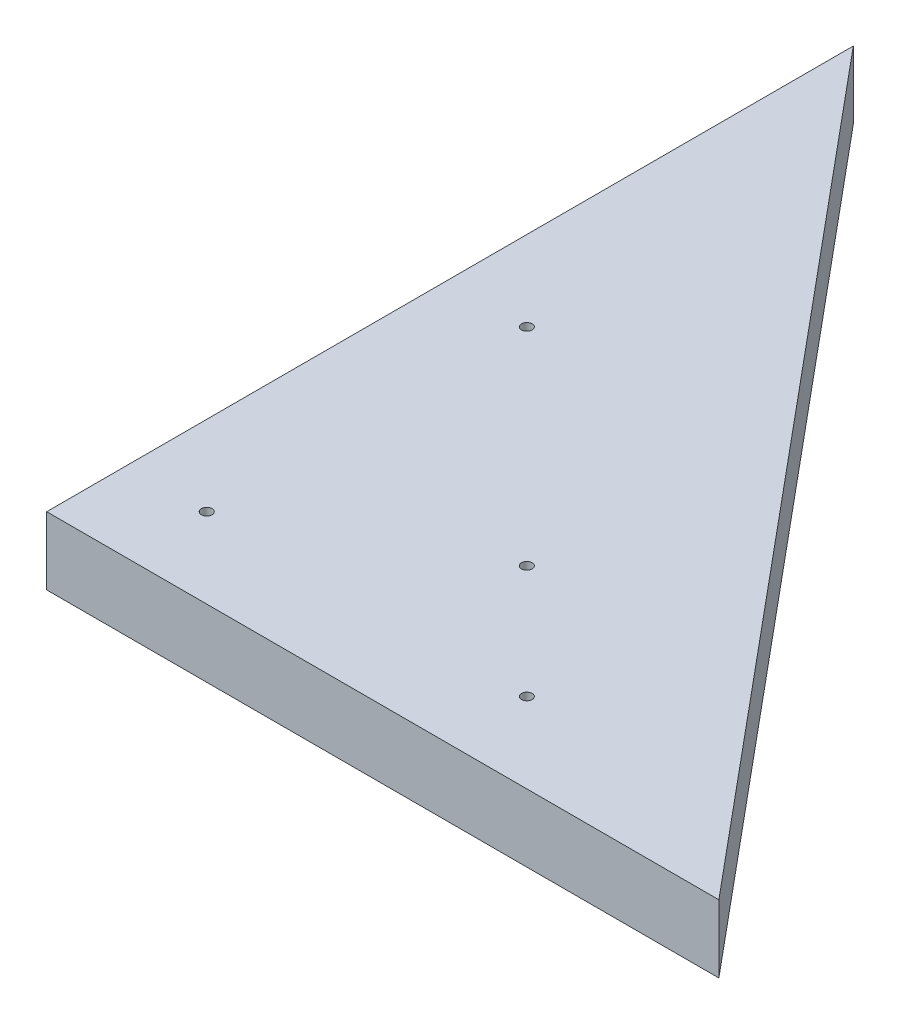
ISO-10303-21;
HEADER;
FILE_DESCRIPTION(('STEP AP214'),'2;1');
FILE_NAME('part.step','',(''),(''),'','','');
FILE_SCHEMA(('AUTOMOTIVE_DESIGN { 1 0 10303 214 1 1 1 1 }'));
ENDSEC;
DATA;
#1=APPLICATION_CONTEXT('core data for automotive mechanical design processes');
#2=APPLICATION_PROTOCOL_DEFINITION('international standard','automotive_design',2000,#1);
#3=PRODUCT_CONTEXT('',#1,'mechanical');
#4=PRODUCT('Part','Part','',(#3));
#5=PRODUCT_RELATED_PRODUCT_CATEGORY('part','',(#4));
#6=PRODUCT_DEFINITION_FORMATION('','',#4);
#7=PRODUCT_DEFINITION_CONTEXT('part definition',#1,'design');
#8=PRODUCT_DEFINITION('design','',#6,#7);
#9=PRODUCT_DEFINITION_SHAPE('','',#8);
#10=(LENGTH_UNIT() NAMED_UNIT(*) SI_UNIT(.MILLI.,.METRE.));
#11=(NAMED_UNIT(*) PLANE_ANGLE_UNIT() SI_UNIT($,.RADIAN.));
#12=(NAMED_UNIT(*) SI_UNIT($,.STERADIAN.) SOLID_ANGLE_UNIT());
#13=UNCERTAINTY_MEASURE_WITH_UNIT(LENGTH_MEASURE(1.E-05),#10,'distance_accuracy_value','');
#14=(GEOMETRIC_REPRESENTATION_CONTEXT(3) GLOBAL_UNCERTAINTY_ASSIGNED_CONTEXT((#13)) GLOBAL_UNIT_ASSIGNED_CONTEXT((#10,
#11,#12)) REPRESENTATION_CONTEXT('',''));
#15=CARTESIAN_POINT('',(0.,0.,0.));
#16=DIRECTION('',(0.,0.,1.));
#17=DIRECTION('',(1.,0.,0.));
#18=AXIS2_PLACEMENT_3D('',#15,#16,#17);
#19=CARTESIAN_POINT('',(-30.,209.518291832848,30.));
#20=DIRECTION('',(0.,-1.,0.));
#21=DIRECTION('',(0.,0.,-1.));
#22=AXIS2_PLACEMENT_3D('',#19,#20,#21);
#23=CYLINDRICAL_SURFACE('',#22,0.999999999999998);
#24=CARTESIAN_POINT('',(-30.,0.,30.));
#25=DIRECTION('',(0.,1.,0.));
#26=DIRECTION('',(0.,0.,1.));
#27=AXIS2_PLACEMENT_3D('',#24,#25,#26);
#28=CIRCLE('',#27,0.999999999999998);
#29=CARTESIAN_POINT('',(-30.,0.,29.));
#30=VERTEX_POINT('',#29);
#31=EDGE_CURVE('E95',#30,#30,#28,.T.);
#32=CARTESIAN_POINT('',(-30.,12.7,30.));
#33=DIRECTION('',(0.,1.,0.));
#34=DIRECTION('',(0.,0.,1.));
#35=AXIS2_PLACEMENT_3D('',#32,#33,#34);
#36=CIRCLE('',#35,0.999999999999998);
#37=CARTESIAN_POINT('',(-30.,12.7,29.));
#38=VERTEX_POINT('',#37);
#39=EDGE_CURVE('E86',#38,#38,#36,.T.);
#40=CARTESIAN_POINT('',(-30.,0.,29.));
#41=CARTESIAN_POINT('',(-30.,0.132291666666636,29.));
#42=CARTESIAN_POINT('',(-30.,0.2645833333333,29.));
#43=CARTESIAN_POINT('',(-30.,0.529166666666636,29.));
#44=CARTESIAN_POINT('',(-30.,0.661458333333309,29.));
#45=CARTESIAN_POINT('',(-30.,0.926041666666646,29.));
#46=CARTESIAN_POINT('',(-30.,1.05833333333331,29.));
#47=CARTESIAN_POINT('',(-30.,1.32291666666664,29.));
#48=CARTESIAN_POINT('',(-30.,1.4552083333333,29.));
#49=CARTESIAN_POINT('',(-30.,1.71979166666664,29.));
#50=CARTESIAN_POINT('',(-30.,1.85208333333331,29.));
#51=CARTESIAN_POINT('',(-30.,2.11666666666665,29.));
#52=CARTESIAN_POINT('',(-30.,2.24895833333331,29.));
#53=CARTESIAN_POINT('',(-30.,2.51354166666664,29.));
#54=CARTESIAN_POINT('',(-30.,2.6458333333333,29.));
#55=CARTESIAN_POINT('',(-30.,2.91041666666663,29.));
#56=CARTESIAN_POINT('',(-30.,3.04270833333329,29.));
#57=CARTESIAN_POINT('',(-30.,3.30729166666663,29.));
#58=CARTESIAN_POINT('',(-30.,3.4395833333333,29.));
#59=CARTESIAN_POINT('',(-30.,3.70416666666664,29.));
#60=CARTESIAN_POINT('',(-30.,3.8364583333333,29.));
#61=CARTESIAN_POINT('',(-30.,4.10104166666663,29.));
#62=CARTESIAN_POINT('',(-30.,4.23333333333329,29.));
#63=CARTESIAN_POINT('',(-30.,4.49791666666663,29.));
#64=CARTESIAN_POINT('',(-30.,4.6302083333333,29.));
#65=CARTESIAN_POINT('',(-30.,4.89479166666664,29.));
#66=CARTESIAN_POINT('',(-30.,5.0270833333333,29.));
#67=CARTESIAN_POINT('',(-30.,5.29166666666663,29.));
#68=CARTESIAN_POINT('',(-30.,5.42395833333329,29.));
#69=CARTESIAN_POINT('',(-30.,5.68854166666663,29.));
#70=CARTESIAN_POINT('',(-30.,5.8208333333333,29.));
#71=CARTESIAN_POINT('',(-30.,6.08541666666664,29.));
#72=CARTESIAN_POINT('',(-30.,6.2177083333333,29.));
#73=CARTESIAN_POINT('',(-30.,6.48229166666663,29.));
#74=CARTESIAN_POINT('',(-30.,6.61458333333329,29.));
#75=CARTESIAN_POINT('',(-30.,6.87916666666663,29.));
#76=CARTESIAN_POINT('',(-30.,7.0114583333333,29.));
#77=CARTESIAN_POINT('',(-30.,7.27604166666664,29.));
#78=CARTESIAN_POINT('',(-30.,7.4083333333333,29.));
#79=CARTESIAN_POINT('',(-30.,7.67291666666663,29.));
#80=CARTESIAN_POINT('',(-30.,7.80520833333329,29.));
#81=CARTESIAN_POINT('',(-30.,8.06979166666663,29.));
#82=CARTESIAN_POINT('',(-30.,8.2020833333333,29.));
#83=CARTESIAN_POINT('',(-30.,8.46666666666664,29.));
#84=CARTESIAN_POINT('',(-30.,8.5989583333333,29.));
#85=CARTESIAN_POINT('',(-30.,8.86354166666663,29.));
#86=CARTESIAN_POINT('',(-30.,8.99583333333329,29.));
#87=CARTESIAN_POINT('',(-30.,9.26041666666663,29.));
#88=CARTESIAN_POINT('',(-30.,9.3927083333333,29.));
#89=CARTESIAN_POINT('',(-30.,9.65729166666664,29.));
#90=CARTESIAN_POINT('',(-30.,9.7895833333333,29.));
#91=CARTESIAN_POINT('',(-30.,10.0541666666666,29.));
#92=CARTESIAN_POINT('',(-30.,10.1864583333333,29.));
#93=CARTESIAN_POINT('',(-30.,10.4510416666666,29.));
#94=CARTESIAN_POINT('',(-30.,10.5833333333333,29.));
#95=CARTESIAN_POINT('',(-30.,10.8479166666666,29.));
#96=CARTESIAN_POINT('',(-30.,10.9802083333333,29.));
#97=CARTESIAN_POINT('',(-30.,11.2447916666666,29.));
#98=CARTESIAN_POINT('',(-30.,11.3770833333333,29.));
#99=CARTESIAN_POINT('',(-30.,11.6416666666666,29.));
#100=CARTESIAN_POINT('',(-30.,11.7739583333333,29.));
#101=CARTESIAN_POINT('',(-30.,12.0385416666666,29.));
#102=CARTESIAN_POINT('',(-30.,12.1708333333333,29.));
#103=CARTESIAN_POINT('',(-30.,12.4354166666666,29.));
#104=CARTESIAN_POINT('',(-30.,12.5677083333333,29.));
#105=CARTESIAN_POINT('',(-30.,12.7,29.));
#106=B_SPLINE_CURVE_WITH_KNOTS('',3,(#40,#41,#42,#43,#44,#45,#46,#47,#48,#49,#50,#51,#52,#53,
#54,#55,#56,#57,#58,#59,#60,#61,#62,#63,#64,#65,#66,#67,#68,#69,#70,#71,#72,#73,#74,#75,#76,#77,
#78,#79,#80,#81,#82,#83,#84,#85,#86,#87,#88,#89,#90,#91,#92,#93,#94,#95,#96,#97,#98,#99,#100,
#101,#102,#103,#104,#105),.UNSPECIFIED.,.F.,.F.,(4,2,2,2,2,2,2,2,2,2,2,2,2,2,2,2,2,2,2,2,2,2,2,
2,2,2,2,2,2,2,2,2,4),(0.,0.396874999999991,0.79375000000001,1.190625,1.58749999999999,
1.98437500000001,2.38125,2.77812499999999,3.17499999999998,3.571875,3.96874999999999,
4.36562499999998,4.7625,5.15937499999999,5.55624999999998,5.953125,6.34999999999999,
6.74687499999999,7.14375,7.540625,7.93749999999999,8.334375,8.73125,9.12812499999999,
9.52500000000001,9.921875,10.31875,10.715625,11.1125,11.509375,11.90625,12.303125,12.7),.UNSPECIFIED.);
#107=EDGE_CURVE('BSEAM33',#30,#38,#106,.T.);
#108=ORIENTED_EDGE('',*,*,#31,.F.);
#109=ORIENTED_EDGE('',*,*,#39,.T.);
#110=ORIENTED_EDGE('',*,*,#107,.T.);
#111=ORIENTED_EDGE('',*,*,#107,.F.);
#112=EDGE_LOOP('',(#108,#110,#109,#111));
#113=FACE_BOUND('',#112,.T.);
#114=ADVANCED_FACE('F33',(#113),#23,.F.);
#115=CARTESIAN_POINT('',(81.,209.518291832848,45.));
#116=DIRECTION('',(0.,0.,-1.));
#117=DIRECTION('',(-1.,0.,0.));
#118=AXIS2_PLACEMENT_3D('',#115,#116,#117);
#119=PLANE('',#118);
#120=DIRECTION('',(1.,0.,0.));
#121=VECTOR('',#120,1.);
#122=CARTESIAN_POINT('',(81.,12.7,45.));
#123=LINE('',#122,#121);
#124=CARTESIAN_POINT('',(-45.,12.7,45.));
#125=VERTEX_POINT('',#124);
#126=CARTESIAN_POINT('',(81.,12.7,45.));
#127=VERTEX_POINT('',#126);
#128=EDGE_CURVE('E69',#125,#127,#123,.T.);
#129=ORIENTED_EDGE('',*,*,#128,.F.);
#130=DIRECTION('',(0.,-1.,0.));
#131=VECTOR('',#130,1.);
#132=CARTESIAN_POINT('',(-45.,209.518291832848,45.));
#133=LINE('',#132,#131);
#134=CARTESIAN_POINT('',(-45.,0.,45.));
#135=VERTEX_POINT('',#134);
#136=EDGE_CURVE('E42',#125,#135,#133,.T.);
#137=ORIENTED_EDGE('',*,*,#136,.T.);
#138=DIRECTION('',(1.,0.,0.));
#139=VECTOR('',#138,1.);
#140=CARTESIAN_POINT('',(81.,0.,45.));
#141=LINE('',#140,#139);
#142=CARTESIAN_POINT('',(81.,0.,45.));
#143=VERTEX_POINT('',#142);
#144=EDGE_CURVE('E71',#135,#143,#141,.T.);
#145=ORIENTED_EDGE('',*,*,#144,.T.);
#146=DIRECTION('',(0.,-1.,0.));
#147=VECTOR('',#146,1.);
#148=CARTESIAN_POINT('',(81.,209.518291832848,45.));
#149=LINE('',#148,#147);
#150=EDGE_CURVE('E65',#127,#143,#149,.T.);
#151=ORIENTED_EDGE('',*,*,#150,.F.);
#152=EDGE_LOOP('',(#129,#137,#145,#151));
#153=FACE_BOUND('',#152,.T.);
#154=ADVANCED_FACE('F67',(#153),#119,.F.);
#155=CARTESIAN_POINT('',(-45.,209.518291832848,45.));
#156=DIRECTION('',(1.,0.,0.));
#157=DIRECTION('',(0.,0.,-1.));
#158=AXIS2_PLACEMENT_3D('',#155,#156,#157);
#159=PLANE('',#158);
#160=DIRECTION('',(0.,0.,1.));
#161=VECTOR('',#160,1.);
#162=CARTESIAN_POINT('',(-45.,12.7,45.));
#163=LINE('',#162,#161);
#164=CARTESIAN_POINT('',(-45.,12.7,-106.2));
#165=VERTEX_POINT('',#164);
#166=EDGE_CURVE('E52',#165,#125,#163,.T.);
#167=ORIENTED_EDGE('',*,*,#166,.F.);
#168=DIRECTION('',(0.,-1.,0.));
#169=VECTOR('',#168,1.);
#170=CARTESIAN_POINT('',(-45.,209.518291832848,-106.2));
#171=LINE('',#170,#169);
#172=CARTESIAN_POINT('',(-45.,0.,-106.2));
#173=VERTEX_POINT('',#172);
#174=EDGE_CURVE('E11',#165,#173,#171,.T.);
#175=ORIENTED_EDGE('',*,*,#174,.T.);
#176=DIRECTION('',(0.,0.,1.));
#177=VECTOR('',#176,1.);
#178=CARTESIAN_POINT('',(-45.,0.,45.));
#179=LINE('',#178,#177);
#180=EDGE_CURVE('E103',#173,#135,#179,.T.);
#181=ORIENTED_EDGE('',*,*,#180,.T.);
#182=ORIENTED_EDGE('',*,*,#136,.F.);
#183=EDGE_LOOP('',(#167,#175,#181,#182));
#184=FACE_BOUND('',#183,.T.);
#185=ADVANCED_FACE('F107',(#184),#159,.F.);
#186=CARTESIAN_POINT('',(-45.,209.518291832848,-106.2));
#187=DIRECTION('',(-0.768221279597376,0.,0.64018439966448));
#188=DIRECTION('',(0.64018439966448,0.,0.768221279597376));
#189=AXIS2_PLACEMENT_3D('',#186,#187,#188);
#190=PLANE('',#189);
#191=DIRECTION('',(-0.64018439966448,0.,-0.768221279597376));
#192=VECTOR('',#191,1.);
#193=CARTESIAN_POINT('',(-45.,12.7,-106.2));
#194=LINE('',#193,#192);
#195=EDGE_CURVE('E77',#127,#165,#194,.T.);
#196=ORIENTED_EDGE('',*,*,#195,.F.);
#197=ORIENTED_EDGE('',*,*,#150,.T.);
#198=DIRECTION('',(-0.64018439966448,0.,-0.768221279597376));
#199=VECTOR('',#198,1.);
#200=CARTESIAN_POINT('',(-45.,0.,-106.2));
#201=LINE('',#200,#199);
#202=EDGE_CURVE('E101',#143,#173,#201,.T.);
#203=ORIENTED_EDGE('',*,*,#202,.T.);
#204=ORIENTED_EDGE('',*,*,#174,.F.);
#205=EDGE_LOOP('',(#196,#197,#203,#204));
#206=FACE_BOUND('',#205,.T.);
#207=ADVANCED_FACE('F35',(#206),#190,.F.);
#208=CARTESIAN_POINT('',(-30.,209.518291832848,-30.));
#209=DIRECTION('',(0.,-1.,0.));
#210=DIRECTION('',(0.,0.,-1.));
#211=AXIS2_PLACEMENT_3D('',#208,#209,#210);
#212=CYLINDRICAL_SURFACE('',#211,0.999999999999998);
#213=CARTESIAN_POINT('',(-30.,0.,-30.));
#214=DIRECTION('',(0.,1.,0.));
#215=DIRECTION('',(0.,0.,1.));
#216=AXIS2_PLACEMENT_3D('',#213,#214,#215);
#217=CIRCLE('',#216,0.999999999999998);
#218=CARTESIAN_POINT('',(-30.,0.,-31.));
#219=VERTEX_POINT('',#218);
#220=EDGE_CURVE('E98',#219,#219,#217,.T.);
#221=CARTESIAN_POINT('',(-30.,12.7,-30.));
#222=DIRECTION('',(0.,1.,0.));
#223=DIRECTION('',(0.,0.,1.));
#224=AXIS2_PLACEMENT_3D('',#221,#222,#223);
#225=CIRCLE('',#224,0.999999999999998);
#226=CARTESIAN_POINT('',(-30.,12.7,-31.));
#227=VERTEX_POINT('',#226);
#228=EDGE_CURVE('E82',#227,#227,#225,.T.);
#229=CARTESIAN_POINT('',(-30.,0.,-31.));
#230=CARTESIAN_POINT('',(-30.,0.132291666666636,-31.));
#231=CARTESIAN_POINT('',(-30.,0.2645833333333,-31.));
#232=CARTESIAN_POINT('',(-30.,0.529166666666636,-31.));
#233=CARTESIAN_POINT('',(-30.,0.661458333333309,-31.));
#234=CARTESIAN_POINT('',(-30.,0.926041666666646,-31.));
#235=CARTESIAN_POINT('',(-30.,1.05833333333331,-31.));
#236=CARTESIAN_POINT('',(-30.,1.32291666666664,-31.));
#237=CARTESIAN_POINT('',(-30.,1.4552083333333,-31.));
#238=CARTESIAN_POINT('',(-30.,1.71979166666664,-31.));
#239=CARTESIAN_POINT('',(-30.,1.85208333333331,-31.));
#240=CARTESIAN_POINT('',(-30.,2.11666666666665,-31.));
#241=CARTESIAN_POINT('',(-30.,2.24895833333331,-31.));
#242=CARTESIAN_POINT('',(-30.,2.51354166666664,-31.));
#243=CARTESIAN_POINT('',(-30.,2.6458333333333,-31.));
#244=CARTESIAN_POINT('',(-30.,2.91041666666663,-31.));
#245=CARTESIAN_POINT('',(-30.,3.04270833333329,-31.));
#246=CARTESIAN_POINT('',(-30.,3.30729166666663,-31.));
#247=CARTESIAN_POINT('',(-30.,3.4395833333333,-31.));
#248=CARTESIAN_POINT('',(-30.,3.70416666666664,-31.));
#249=CARTESIAN_POINT('',(-30.,3.8364583333333,-31.));
#250=CARTESIAN_POINT('',(-30.,4.10104166666663,-31.));
#251=CARTESIAN_POINT('',(-30.,4.23333333333329,-31.));
#252=CARTESIAN_POINT('',(-30.,4.49791666666663,-31.));
#253=CARTESIAN_POINT('',(-30.,4.6302083333333,-31.));
#254=CARTESIAN_POINT('',(-30.,4.89479166666664,-31.));
#255=CARTESIAN_POINT('',(-30.,5.0270833333333,-31.));
#256=CARTESIAN_POINT('',(-30.,5.29166666666663,-31.));
#257=CARTESIAN_POINT('',(-30.,5.42395833333329,-31.));
#258=CARTESIAN_POINT('',(-30.,5.68854166666663,-31.));
#259=CARTESIAN_POINT('',(-30.,5.8208333333333,-31.));
#260=CARTESIAN_POINT('',(-30.,6.08541666666664,-31.));
#261=CARTESIAN_POINT('',(-30.,6.2177083333333,-31.));
#262=CARTESIAN_POINT('',(-30.,6.48229166666663,-31.));
#263=CARTESIAN_POINT('',(-30.,6.61458333333329,-31.));
#264=CARTESIAN_POINT('',(-30.,6.87916666666663,-31.));
#265=CARTESIAN_POINT('',(-30.,7.0114583333333,-31.));
#266=CARTESIAN_POINT('',(-30.,7.27604166666664,-31.));
#267=CARTESIAN_POINT('',(-30.,7.4083333333333,-31.));
#268=CARTESIAN_POINT('',(-30.,7.67291666666663,-31.));
#269=CARTESIAN_POINT('',(-30.,7.80520833333329,-31.));
#270=CARTESIAN_POINT('',(-30.,8.06979166666663,-31.));
#271=CARTESIAN_POINT('',(-30.,8.2020833333333,-31.));
#272=CARTESIAN_POINT('',(-30.,8.46666666666664,-31.));
#273=CARTESIAN_POINT('',(-30.,8.5989583333333,-31.));
#274=CARTESIAN_POINT('',(-30.,8.86354166666663,-31.));
#275=CARTESIAN_POINT('',(-30.,8.99583333333329,-31.));
#276=CARTESIAN_POINT('',(-30.,9.26041666666663,-31.));
#277=CARTESIAN_POINT('',(-30.,9.3927083333333,-31.));
#278=CARTESIAN_POINT('',(-30.,9.65729166666664,-31.));
#279=CARTESIAN_POINT('',(-30.,9.7895833333333,-31.));
#280=CARTESIAN_POINT('',(-30.,10.0541666666666,-31.));
#281=CARTESIAN_POINT('',(-30.,10.1864583333333,-31.));
#282=CARTESIAN_POINT('',(-30.,10.4510416666666,-31.));
#283=CARTESIAN_POINT('',(-30.,10.5833333333333,-31.));
#284=CARTESIAN_POINT('',(-30.,10.8479166666666,-31.));
#285=CARTESIAN_POINT('',(-30.,10.9802083333333,-31.));
#286=CARTESIAN_POINT('',(-30.,11.2447916666666,-31.));
#287=CARTESIAN_POINT('',(-30.,11.3770833333333,-31.));
#288=CARTESIAN_POINT('',(-30.,11.6416666666666,-31.));
#289=CARTESIAN_POINT('',(-30.,11.7739583333333,-31.));
#290=CARTESIAN_POINT('',(-30.,12.0385416666666,-31.));
#291=CARTESIAN_POINT('',(-30.,12.1708333333333,-31.));
#292=CARTESIAN_POINT('',(-30.,12.4354166666666,-31.));
#293=CARTESIAN_POINT('',(-30.,12.5677083333333,-31.));
#294=CARTESIAN_POINT('',(-30.,12.7,-31.));
#295=B_SPLINE_CURVE_WITH_KNOTS('',3,(#229,#230,#231,#232,#233,#234,#235,#236,#237,#238,#239,
#240,#241,#242,#243,#244,#245,#246,#247,#248,#249,#250,#251,#252,#253,#254,#255,#256,#257,#258,
#259,#260,#261,#262,#263,#264,#265,#266,#267,#268,#269,#270,#271,#272,#273,#274,#275,#276,#277,
#278,#279,#280,#281,#282,#283,#284,#285,#286,#287,#288,#289,#290,#291,#292,#293,#294),
.UNSPECIFIED.,.F.,.F.,(4,2,2,2,2,2,2,2,2,2,2,2,2,2,2,2,2,2,2,2,2,2,2,2,2,2,2,2,2,2,2,2,4),(0.,
0.396874999999991,0.79375000000001,1.190625,1.58749999999999,1.98437500000001,2.38125,
2.77812499999999,3.17499999999998,3.571875,3.96874999999999,4.36562499999998,4.7625,
5.15937499999999,5.55624999999998,5.953125,6.34999999999999,6.74687499999999,7.14375,7.540625,
7.93749999999999,8.334375,8.73125,9.12812499999999,9.52500000000001,9.921875,10.31875,10.715625,
11.1125,11.509375,11.90625,12.303125,12.7),.UNSPECIFIED.);
#296=EDGE_CURVE('BSEAM140',#219,#227,#295,.T.);
#297=ORIENTED_EDGE('',*,*,#220,.F.);
#298=ORIENTED_EDGE('',*,*,#228,.T.);
#299=ORIENTED_EDGE('',*,*,#296,.T.);
#300=ORIENTED_EDGE('',*,*,#296,.F.);
#301=EDGE_LOOP('',(#297,#299,#298,#300));
#302=FACE_BOUND('',#301,.T.);
#303=ADVANCED_FACE('F140',(#302),#212,.F.);
#304=CARTESIAN_POINT('',(8.78679656440357,209.518291832848,8.78679656440358));
#305=DIRECTION('',(0.,-1.,0.));
#306=DIRECTION('',(0.,0.,-1.));
#307=AXIS2_PLACEMENT_3D('',#304,#305,#306);
#308=CYLINDRICAL_SURFACE('',#307,1.);
#309=CARTESIAN_POINT('',(8.78679656440357,0.,8.78679656440358));
#310=DIRECTION('',(0.,1.,0.));
#311=DIRECTION('',(0.,0.,1.));
#312=AXIS2_PLACEMENT_3D('',#309,#310,#311);
#313=CIRCLE('',#312,1.);
#314=CARTESIAN_POINT('',(8.78679656440357,0.,7.78679656440357));
#315=VERTEX_POINT('',#314);
#316=EDGE_CURVE('E92',#315,#315,#313,.T.);
#317=CARTESIAN_POINT('',(8.78679656440357,12.7,8.78679656440358));
#318=DIRECTION('',(0.,1.,0.));
#319=DIRECTION('',(0.,0.,1.));
#320=AXIS2_PLACEMENT_3D('',#317,#318,#319);
#321=CIRCLE('',#320,1.);
#322=CARTESIAN_POINT('',(8.78679656440357,12.7,7.78679656440357));
#323=VERTEX_POINT('',#322);
#324=EDGE_CURVE('E126',#323,#323,#321,.T.);
#325=CARTESIAN_POINT('',(8.78679656440357,0.,7.78679656440357));
#326=CARTESIAN_POINT('',(8.78679656440357,0.132291666666636,7.78679656440357));
#327=CARTESIAN_POINT('',(8.78679656440357,0.2645833333333,7.78679656440357));
#328=CARTESIAN_POINT('',(8.78679656440357,0.529166666666636,7.78679656440357));
#329=CARTESIAN_POINT('',(8.78679656440357,0.661458333333309,7.78679656440357));
#330=CARTESIAN_POINT('',(8.78679656440357,0.926041666666646,7.78679656440357));
#331=CARTESIAN_POINT('',(8.78679656440357,1.05833333333331,7.78679656440357));
#332=CARTESIAN_POINT('',(8.78679656440357,1.32291666666664,7.78679656440357));
#333=CARTESIAN_POINT('',(8.78679656440357,1.4552083333333,7.78679656440357));
#334=CARTESIAN_POINT('',(8.78679656440357,1.71979166666664,7.78679656440357));
#335=CARTESIAN_POINT('',(8.78679656440357,1.85208333333331,7.78679656440357));
#336=CARTESIAN_POINT('',(8.78679656440357,2.11666666666665,7.78679656440357));
#337=CARTESIAN_POINT('',(8.78679656440357,2.24895833333331,7.78679656440357));
#338=CARTESIAN_POINT('',(8.78679656440357,2.51354166666664,7.78679656440357));
#339=CARTESIAN_POINT('',(8.78679656440357,2.6458333333333,7.78679656440357));
#340=CARTESIAN_POINT('',(8.78679656440357,2.91041666666663,7.78679656440357));
#341=CARTESIAN_POINT('',(8.78679656440357,3.04270833333329,7.78679656440357));
#342=CARTESIAN_POINT('',(8.78679656440357,3.30729166666663,7.78679656440357));
#343=CARTESIAN_POINT('',(8.78679656440357,3.4395833333333,7.78679656440357));
#344=CARTESIAN_POINT('',(8.78679656440357,3.70416666666664,7.78679656440357));
#345=CARTESIAN_POINT('',(8.78679656440357,3.8364583333333,7.78679656440357));
#346=CARTESIAN_POINT('',(8.78679656440357,4.10104166666663,7.78679656440357));
#347=CARTESIAN_POINT('',(8.78679656440357,4.23333333333329,7.78679656440357));
#348=CARTESIAN_POINT('',(8.78679656440357,4.49791666666663,7.78679656440357));
#349=CARTESIAN_POINT('',(8.78679656440357,4.6302083333333,7.78679656440357));
#350=CARTESIAN_POINT('',(8.78679656440357,4.89479166666664,7.78679656440357));
#351=CARTESIAN_POINT('',(8.78679656440357,5.0270833333333,7.78679656440357));
#352=CARTESIAN_POINT('',(8.78679656440357,5.29166666666663,7.78679656440357));
#353=CARTESIAN_POINT('',(8.78679656440357,5.42395833333329,7.78679656440357));
#354=CARTESIAN_POINT('',(8.78679656440357,5.68854166666663,7.78679656440357));
#355=CARTESIAN_POINT('',(8.78679656440357,5.8208333333333,7.78679656440357));
#356=CARTESIAN_POINT('',(8.78679656440357,6.08541666666664,7.78679656440357));
#357=CARTESIAN_POINT('',(8.78679656440357,6.2177083333333,7.78679656440357));
#358=CARTESIAN_POINT('',(8.78679656440357,6.48229166666663,7.78679656440357));
#359=CARTESIAN_POINT('',(8.78679656440357,6.61458333333329,7.78679656440357));
#360=CARTESIAN_POINT('',(8.78679656440357,6.87916666666663,7.78679656440357));
#361=CARTESIAN_POINT('',(8.78679656440357,7.0114583333333,7.78679656440357));
#362=CARTESIAN_POINT('',(8.78679656440357,7.27604166666664,7.78679656440357));
#363=CARTESIAN_POINT('',(8.78679656440357,7.4083333333333,7.78679656440357));
#364=CARTESIAN_POINT('',(8.78679656440357,7.67291666666663,7.78679656440357));
#365=CARTESIAN_POINT('',(8.78679656440357,7.80520833333329,7.78679656440357));
#366=CARTESIAN_POINT('',(8.78679656440357,8.06979166666663,7.78679656440357));
#367=CARTESIAN_POINT('',(8.78679656440357,8.2020833333333,7.78679656440357));
#368=CARTESIAN_POINT('',(8.78679656440357,8.46666666666664,7.78679656440357));
#369=CARTESIAN_POINT('',(8.78679656440357,8.5989583333333,7.78679656440357));
#370=CARTESIAN_POINT('',(8.78679656440357,8.86354166666663,7.78679656440357));
#371=CARTESIAN_POINT('',(8.78679656440357,8.99583333333329,7.78679656440357));
#372=CARTESIAN_POINT('',(8.78679656440357,9.26041666666663,7.78679656440357));
#373=CARTESIAN_POINT('',(8.78679656440357,9.3927083333333,7.78679656440357));
#374=CARTESIAN_POINT('',(8.78679656440357,9.65729166666664,7.78679656440357));
#375=CARTESIAN_POINT('',(8.78679656440357,9.7895833333333,7.78679656440357));
#376=CARTESIAN_POINT('',(8.78679656440357,10.0541666666666,7.78679656440357));
#377=CARTESIAN_POINT('',(8.78679656440357,10.1864583333333,7.78679656440357));
#378=CARTESIAN_POINT('',(8.78679656440357,10.4510416666666,7.78679656440357));
#379=CARTESIAN_POINT('',(8.78679656440357,10.5833333333333,7.78679656440357));
#380=CARTESIAN_POINT('',(8.78679656440357,10.8479166666666,7.78679656440357));
#381=CARTESIAN_POINT('',(8.78679656440357,10.9802083333333,7.78679656440357));
#382=CARTESIAN_POINT('',(8.78679656440357,11.2447916666666,7.78679656440357));
#383=CARTESIAN_POINT('',(8.78679656440357,11.3770833333333,7.78679656440357));
#384=CARTESIAN_POINT('',(8.78679656440357,11.6416666666666,7.78679656440357));
#385=CARTESIAN_POINT('',(8.78679656440357,11.7739583333333,7.78679656440357));
#386=CARTESIAN_POINT('',(8.78679656440357,12.0385416666666,7.78679656440357));
#387=CARTESIAN_POINT('',(8.78679656440357,12.1708333333333,7.78679656440357));
#388=CARTESIAN_POINT('',(8.78679656440357,12.4354166666666,7.78679656440357));
#389=CARTESIAN_POINT('',(8.78679656440357,12.5677083333333,7.78679656440357));
#390=CARTESIAN_POINT('',(8.78679656440357,12.7,7.78679656440357));
#391=B_SPLINE_CURVE_WITH_KNOTS('',3,(#325,#326,#327,#328,#329,#330,#331,#332,#333,#334,#335,
#336,#337,#338,#339,#340,#341,#342,#343,#344,#345,#346,#347,#348,#349,#350,#351,#352,#353,#354,
#355,#356,#357,#358,#359,#360,#361,#362,#363,#364,#365,#366,#367,#368,#369,#370,#371,#372,#373,
#374,#375,#376,#377,#378,#379,#380,#381,#382,#383,#384,#385,#386,#387,#388,#389,#390),
.UNSPECIFIED.,.F.,.F.,(4,2,2,2,2,2,2,2,2,2,2,2,2,2,2,2,2,2,2,2,2,2,2,2,2,2,2,2,2,2,2,2,4),(0.,
0.396874999999991,0.79375000000001,1.190625,1.58749999999999,1.98437500000001,2.38125,
2.77812499999999,3.17499999999998,3.571875,3.96874999999999,4.36562499999998,4.7625,
5.15937499999999,5.55624999999998,5.953125,6.34999999999999,6.74687499999999,7.14375,7.540625,
7.93749999999999,8.334375,8.73125,9.12812499999999,9.52500000000001,9.921875,10.31875,10.715625,
11.1125,11.509375,11.90625,12.303125,12.7),.UNSPECIFIED.);
#392=EDGE_CURVE('BSEAM113',#315,#323,#391,.T.);
#393=ORIENTED_EDGE('',*,*,#316,.F.);
#394=ORIENTED_EDGE('',*,*,#324,.T.);
#395=ORIENTED_EDGE('',*,*,#392,.T.);
#396=ORIENTED_EDGE('',*,*,#392,.F.);
#397=EDGE_LOOP('',(#393,#395,#394,#396));
#398=FACE_BOUND('',#397,.T.);
#399=ADVANCED_FACE('F113',(#398),#308,.F.);
#400=CARTESIAN_POINT('',(0.,0.,0.));
#401=DIRECTION('',(0.,-1.,0.));
#402=DIRECTION('',(0.,0.,-1.));
#403=AXIS2_PLACEMENT_3D('',#400,#401,#402);
#404=PLANE('',#403);
#405=ORIENTED_EDGE('',*,*,#316,.T.);
#406=EDGE_LOOP('',(#405));
#407=FACE_BOUND('',#406,.T.);
#408=ORIENTED_EDGE('',*,*,#220,.T.);
#409=EDGE_LOOP('',(#408));
#410=FACE_BOUND('',#409,.T.);
#411=ORIENTED_EDGE('',*,*,#202,.F.);
#412=ORIENTED_EDGE('',*,*,#144,.F.);
#413=ORIENTED_EDGE('',*,*,#180,.F.);
#414=EDGE_LOOP('',(#411,#412,#413));
#415=FACE_BOUND('',#414,.T.);
#416=ORIENTED_EDGE('',*,*,#31,.T.);
#417=EDGE_LOOP('',(#416));
#418=FACE_BOUND('',#417,.T.);
#419=CARTESIAN_POINT('',(30.,0.,30.));
#420=DIRECTION('',(0.,1.,0.));
#421=DIRECTION('',(0.,0.,1.));
#422=AXIS2_PLACEMENT_3D('',#419,#420,#421);
#423=CIRCLE('',#422,0.999999999999998);
#424=CARTESIAN_POINT('',(30.,0.,29.));
#425=VERTEX_POINT('',#424);
#426=EDGE_CURVE('E79',#425,#425,#423,.T.);
#427=ORIENTED_EDGE('',*,*,#426,.T.);
#428=EDGE_LOOP('',(#427));
#429=FACE_BOUND('',#428,.T.);
#430=ADVANCED_FACE('F109',(#407,#410,#415,#418,#429),#404,.T.);
#431=CARTESIAN_POINT('',(30.,209.518291832848,30.));
#432=DIRECTION('',(0.,-1.,0.));
#433=DIRECTION('',(0.,0.,-1.));
#434=AXIS2_PLACEMENT_3D('',#431,#432,#433);
#435=CYLINDRICAL_SURFACE('',#434,0.999999999999998);
#436=CARTESIAN_POINT('',(30.,12.7,30.));
#437=DIRECTION('',(0.,1.,0.));
#438=DIRECTION('',(0.,0.,1.));
#439=AXIS2_PLACEMENT_3D('',#436,#437,#438);
#440=CIRCLE('',#439,0.999999999999998);
#441=CARTESIAN_POINT('',(30.,12.7,29.));
#442=VERTEX_POINT('',#441);
#443=EDGE_CURVE('E37',#442,#442,#440,.T.);
#444=CARTESIAN_POINT('',(30.,0.,29.));
#445=CARTESIAN_POINT('',(30.,0.132291666666636,29.));
#446=CARTESIAN_POINT('',(30.,0.2645833333333,29.));
#447=CARTESIAN_POINT('',(30.,0.529166666666636,29.));
#448=CARTESIAN_POINT('',(30.,0.661458333333309,29.));
#449=CARTESIAN_POINT('',(30.,0.926041666666646,29.));
#450=CARTESIAN_POINT('',(30.,1.05833333333331,29.));
#451=CARTESIAN_POINT('',(30.,1.32291666666664,29.));
#452=CARTESIAN_POINT('',(30.,1.4552083333333,29.));
#453=CARTESIAN_POINT('',(30.,1.71979166666664,29.));
#454=CARTESIAN_POINT('',(30.,1.85208333333331,29.));
#455=CARTESIAN_POINT('',(30.,2.11666666666665,29.));
#456=CARTESIAN_POINT('',(30.,2.24895833333331,29.));
#457=CARTESIAN_POINT('',(30.,2.51354166666664,29.));
#458=CARTESIAN_POINT('',(30.,2.6458333333333,29.));
#459=CARTESIAN_POINT('',(30.,2.91041666666663,29.));
#460=CARTESIAN_POINT('',(30.,3.04270833333329,29.));
#461=CARTESIAN_POINT('',(30.,3.30729166666663,29.));
#462=CARTESIAN_POINT('',(30.,3.4395833333333,29.));
#463=CARTESIAN_POINT('',(30.,3.70416666666664,29.));
#464=CARTESIAN_POINT('',(30.,3.8364583333333,29.));
#465=CARTESIAN_POINT('',(30.,4.10104166666663,29.));
#466=CARTESIAN_POINT('',(30.,4.23333333333329,29.));
#467=CARTESIAN_POINT('',(30.,4.49791666666663,29.));
#468=CARTESIAN_POINT('',(30.,4.6302083333333,29.));
#469=CARTESIAN_POINT('',(30.,4.89479166666664,29.));
#470=CARTESIAN_POINT('',(30.,5.0270833333333,29.));
#471=CARTESIAN_POINT('',(30.,5.29166666666663,29.));
#472=CARTESIAN_POINT('',(30.,5.42395833333329,29.));
#473=CARTESIAN_POINT('',(30.,5.68854166666663,29.));
#474=CARTESIAN_POINT('',(30.,5.8208333333333,29.));
#475=CARTESIAN_POINT('',(30.,6.08541666666664,29.));
#476=CARTESIAN_POINT('',(30.,6.2177083333333,29.));
#477=CARTESIAN_POINT('',(30.,6.48229166666663,29.));
#478=CARTESIAN_POINT('',(30.,6.61458333333329,29.));
#479=CARTESIAN_POINT('',(30.,6.87916666666663,29.));
#480=CARTESIAN_POINT('',(30.,7.0114583333333,29.));
#481=CARTESIAN_POINT('',(30.,7.27604166666664,29.));
#482=CARTESIAN_POINT('',(30.,7.4083333333333,29.));
#483=CARTESIAN_POINT('',(30.,7.67291666666663,29.));
#484=CARTESIAN_POINT('',(30.,7.80520833333329,29.));
#485=CARTESIAN_POINT('',(30.,8.06979166666663,29.));
#486=CARTESIAN_POINT('',(30.,8.2020833333333,29.));
#487=CARTESIAN_POINT('',(30.,8.46666666666664,29.));
#488=CARTESIAN_POINT('',(30.,8.5989583333333,29.));
#489=CARTESIAN_POINT('',(30.,8.86354166666663,29.));
#490=CARTESIAN_POINT('',(30.,8.99583333333329,29.));
#491=CARTESIAN_POINT('',(30.,9.26041666666663,29.));
#492=CARTESIAN_POINT('',(30.,9.3927083333333,29.));
#493=CARTESIAN_POINT('',(30.,9.65729166666664,29.));
#494=CARTESIAN_POINT('',(30.,9.7895833333333,29.));
#495=CARTESIAN_POINT('',(30.,10.0541666666666,29.));
#496=CARTESIAN_POINT('',(30.,10.1864583333333,29.));
#497=CARTESIAN_POINT('',(30.,10.4510416666666,29.));
#498=CARTESIAN_POINT('',(30.,10.5833333333333,29.));
#499=CARTESIAN_POINT('',(30.,10.8479166666666,29.));
#500=CARTESIAN_POINT('',(30.,10.9802083333333,29.));
#501=CARTESIAN_POINT('',(30.,11.2447916666666,29.));
#502=CARTESIAN_POINT('',(30.,11.3770833333333,29.));
#503=CARTESIAN_POINT('',(30.,11.6416666666666,29.));
#504=CARTESIAN_POINT('',(30.,11.7739583333333,29.));
#505=CARTESIAN_POINT('',(30.,12.0385416666666,29.));
#506=CARTESIAN_POINT('',(30.,12.1708333333333,29.));
#507=CARTESIAN_POINT('',(30.,12.4354166666666,29.));
#508=CARTESIAN_POINT('',(30.,12.5677083333333,29.));
#509=CARTESIAN_POINT('',(30.,12.7,29.));
#510=B_SPLINE_CURVE_WITH_KNOTS('',3,(#444,#445,#446,#447,#448,#449,#450,#451,#452,#453,#454,
#455,#456,#457,#458,#459,#460,#461,#462,#463,#464,#465,#466,#467,#468,#469,#470,#471,#472,#473,
#474,#475,#476,#477,#478,#479,#480,#481,#482,#483,#484,#485,#486,#487,#488,#489,#490,#491,#492,
#493,#494,#495,#496,#497,#498,#499,#500,#501,#502,#503,#504,#505,#506,#507,#508,#509),
.UNSPECIFIED.,.F.,.F.,(4,2,2,2,2,2,2,2,2,2,2,2,2,2,2,2,2,2,2,2,2,2,2,2,2,2,2,2,2,2,2,2,4),(0.,
0.396874999999991,0.79375000000001,1.190625,1.58749999999999,1.98437500000001,2.38125,
2.77812499999999,3.17499999999998,3.571875,3.96874999999999,4.36562499999998,4.7625,
5.15937499999999,5.55624999999998,5.953125,6.34999999999999,6.74687499999999,7.14375,7.540625,
7.93749999999999,8.334375,8.73125,9.12812499999999,9.52500000000001,9.921875,10.31875,10.715625,
11.1125,11.509375,11.90625,12.303125,12.7),.UNSPECIFIED.);
#511=EDGE_CURVE('BSEAM112',#425,#442,#510,.T.);
#512=ORIENTED_EDGE('',*,*,#426,.F.);
#513=ORIENTED_EDGE('',*,*,#443,.T.);
#514=ORIENTED_EDGE('',*,*,#511,.T.);
#515=ORIENTED_EDGE('',*,*,#511,.F.);
#516=EDGE_LOOP('',(#512,#514,#513,#515));
#517=FACE_BOUND('',#516,.T.);
#518=ADVANCED_FACE('F112',(#517),#435,.F.);
#519=CARTESIAN_POINT('',(0.,12.7,0.));
#520=DIRECTION('',(0.,1.,0.));
#521=DIRECTION('',(0.,0.,1.));
#522=AXIS2_PLACEMENT_3D('',#519,#520,#521);
#523=PLANE('',#522);
#524=ORIENTED_EDGE('',*,*,#443,.F.);
#525=EDGE_LOOP('',(#524));
#526=FACE_BOUND('',#525,.T.);
#527=ORIENTED_EDGE('',*,*,#324,.F.);
#528=EDGE_LOOP('',(#527));
#529=FACE_BOUND('',#528,.T.);
#530=ORIENTED_EDGE('',*,*,#39,.F.);
#531=EDGE_LOOP('',(#530));
#532=FACE_BOUND('',#531,.T.);
#533=ORIENTED_EDGE('',*,*,#228,.F.);
#534=EDGE_LOOP('',(#533));
#535=FACE_BOUND('',#534,.T.);
#536=ORIENTED_EDGE('',*,*,#128,.T.);
#537=ORIENTED_EDGE('',*,*,#195,.T.);
#538=ORIENTED_EDGE('',*,*,#166,.T.);
#539=EDGE_LOOP('',(#536,#537,#538));
#540=FACE_BOUND('',#539,.T.);
#541=ADVANCED_FACE('F81',(#526,#529,#532,#535,#540),#523,.T.);
#542=CLOSED_SHELL('',(#114,#154,#185,#207,#303,#399,#430,#518,#541));
#543=MANIFOLD_SOLID_BREP('B2',#542);
#544=ADVANCED_BREP_SHAPE_REPRESENTATION('',(#18,#543),#14);
#545=SHAPE_DEFINITION_REPRESENTATION(#9,#544);
ENDSEC;
END-ISO-10303-21;
